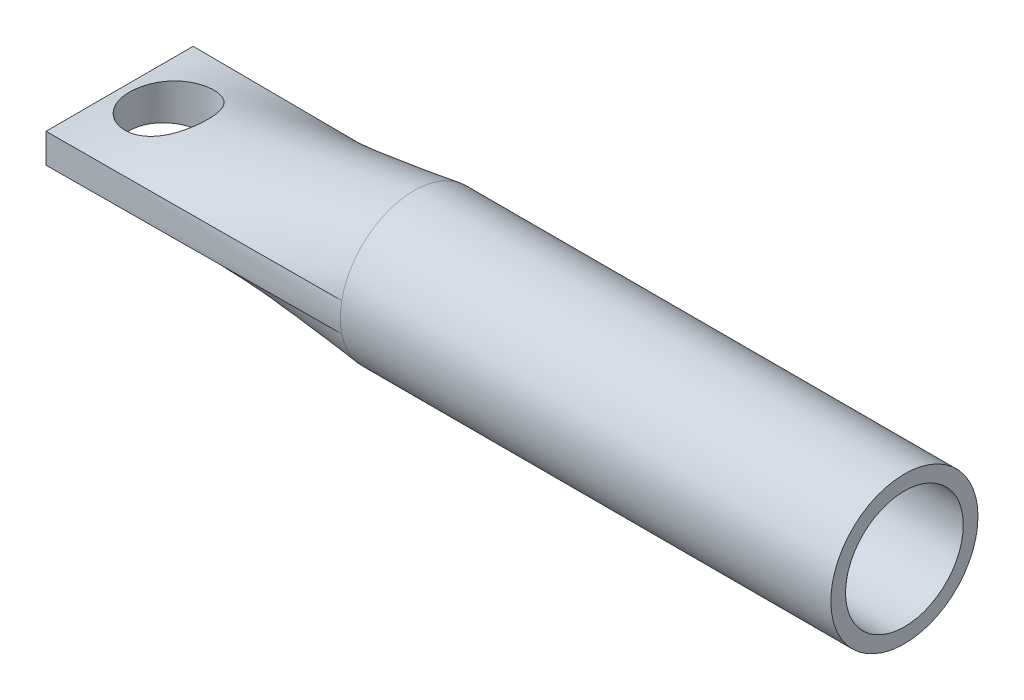
ISO-10303-21;
HEADER;
FILE_DESCRIPTION(('STEP AP214'),'2;1');
FILE_NAME('part.step','',(''),(''),'','','');
FILE_SCHEMA(('AUTOMOTIVE_DESIGN { 1 0 10303 214 1 1 1 1 }'));
ENDSEC;
DATA;
#1=APPLICATION_CONTEXT('core data for automotive mechanical design processes');
#2=APPLICATION_PROTOCOL_DEFINITION('international standard','automotive_design',2000,#1);
#3=PRODUCT_CONTEXT('',#1,'mechanical');
#4=PRODUCT('Part','Part','',(#3));
#5=PRODUCT_RELATED_PRODUCT_CATEGORY('part','',(#4));
#6=PRODUCT_DEFINITION_FORMATION('','',#4);
#7=PRODUCT_DEFINITION_CONTEXT('part definition',#1,'design');
#8=PRODUCT_DEFINITION('design','',#6,#7);
#9=PRODUCT_DEFINITION_SHAPE('','',#8);
#10=(LENGTH_UNIT() NAMED_UNIT(*) SI_UNIT(.MILLI.,.METRE.));
#11=(NAMED_UNIT(*) PLANE_ANGLE_UNIT() SI_UNIT($,.RADIAN.));
#12=(NAMED_UNIT(*) SI_UNIT($,.STERADIAN.) SOLID_ANGLE_UNIT());
#13=UNCERTAINTY_MEASURE_WITH_UNIT(LENGTH_MEASURE(1.E-05),#10,'distance_accuracy_value','');
#14=(GEOMETRIC_REPRESENTATION_CONTEXT(3) GLOBAL_UNCERTAINTY_ASSIGNED_CONTEXT((#13)) GLOBAL_UNIT_ASSIGNED_CONTEXT((#10,
#11,#12)) REPRESENTATION_CONTEXT('',''));
#15=CARTESIAN_POINT('',(0.,0.,0.));
#16=DIRECTION('',(0.,0.,1.));
#17=DIRECTION('',(1.,0.,0.));
#18=AXIS2_PLACEMENT_3D('',#15,#16,#17);
#19=CARTESIAN_POINT('',(50.,0.,0.));
#20=DIRECTION('',(-1.,0.,0.));
#21=DIRECTION('',(0.,0.,1.));
#22=AXIS2_PLACEMENT_3D('',#19,#20,#21);
#23=CYLINDRICAL_SURFACE('',#22,7.5);
#24=CARTESIAN_POINT('',(50.,0.,0.));
#25=DIRECTION('',(1.,0.,0.));
#26=DIRECTION('',(0.,0.,-1.));
#27=AXIS2_PLACEMENT_3D('',#24,#25,#26);
#28=CIRCLE('',#27,7.5);
#29=CARTESIAN_POINT('',(50.,0.,-7.5));
#30=VERTEX_POINT('',#29);
#31=EDGE_CURVE('E12',#30,#30,#28,.T.);
#32=ORIENTED_EDGE('',*,*,#31,.F.);
#33=EDGE_LOOP('',(#32));
#34=FACE_BOUND('',#33,.T.);
#35=CARTESIAN_POINT('',(0.,1.47087101353638,7.3543550676819));
#36=CARTESIAN_POINT('',(0.,2.07183255199792,7.23416275998959));
#37=CARTESIAN_POINT('',(0.,2.7214099506815,7.02829377442113));
#38=CARTESIAN_POINT('',(0.,4.04857514884579,6.35704528561685));
#39=CARTESIAN_POINT('',(0.,4.72646428939145,5.88899546935264));
#40=CARTESIAN_POINT('',(0.,5.65014306972971,4.95159735548262));
#41=CARTESIAN_POINT('',(0.,5.94177102647611,4.60048977603203));
#42=CARTESIAN_POINT('',(0.,6.46772889154709,3.82591585060274));
#43=CARTESIAN_POINT('',(0.,6.70189279433673,3.40241446086019));
#44=CARTESIAN_POINT('',(0.,7.08875869874175,2.49825765309871));
#45=CARTESIAN_POINT('',(0.,7.24127755994481,2.01767237306952));
#46=CARTESIAN_POINT('',(0.,7.44695956411141,1.02464420932239));
#47=CARTESIAN_POINT('',(0.,7.5,0.5123774391991));
#48=CARTESIAN_POINT('',(0.,7.5,-0.512377439199096));
#49=CARTESIAN_POINT('',(0.,7.44695956411141,-1.02464420932239));
#50=CARTESIAN_POINT('',(0.,7.24127755994481,-2.01767237306951));
#51=CARTESIAN_POINT('',(0.,7.08875869874176,-2.4982576530987));
#52=CARTESIAN_POINT('',(0.,6.70189279433673,-3.40241446086019));
#53=CARTESIAN_POINT('',(0.,6.46772889154709,-3.82591585060274));
#54=CARTESIAN_POINT('',(0.,5.94177102647611,-4.60048977603203));
#55=CARTESIAN_POINT('',(0.,5.65014306972971,-4.95159735548262));
#56=CARTESIAN_POINT('',(0.,4.72646428939145,-5.88899546935264));
#57=CARTESIAN_POINT('',(0.,4.04857514884579,-6.35704528561685));
#58=CARTESIAN_POINT('',(0.,2.72140995068151,-7.02829377442113));
#59=CARTESIAN_POINT('',(0.,2.07183255199792,-7.23416275998959));
#60=CARTESIAN_POINT('',(0.,1.47087101353638,-7.3543550676819));
#61=B_SPLINE_CURVE_WITH_KNOTS('',3,(#35,#36,#37,#38,#39,#40,#41,#42,#43,#44,#45,#46,#47,#48,#49,
#50,#51,#52,#53,#54,#55,#56,#57,#58,#59,#60),.UNSPECIFIED.,.F.,.F.,(4,2,2,2,2,2,2,2,2,2,2,2,4),
(0.,0.125,0.25,0.3125,0.375,0.4375,0.5,0.5625,0.625,0.6875,0.75,0.875,1.),.UNSPECIFIED.);
#62=CARTESIAN_POINT('',(0.,1.47087101353638,-7.3543550676819));
#63=VERTEX_POINT('',#62);
#64=CARTESIAN_POINT('',(0.,1.47087107283885,7.354355364444));
#65=VERTEX_POINT('',#64);
#66=EDGE_CURVE('E78',#63,#65,#61,.F.);
#67=ORIENTED_EDGE('',*,*,#66,.T.);
#68=CARTESIAN_POINT('',(0.,0.,0.));
#69=DIRECTION('',(-1.,0.,0.));
#70=DIRECTION('',(0.,0.,-1.));
#71=AXIS2_PLACEMENT_3D('',#68,#69,#70);
#72=CIRCLE('',#71,7.5);
#73=CARTESIAN_POINT('',(0.,-1.47087101353638,7.3543550676819));
#74=VERTEX_POINT('',#73);
#75=EDGE_CURVE('E124',#74,#65,#72,.T.);
#76=ORIENTED_EDGE('',*,*,#75,.F.);
#77=CARTESIAN_POINT('',(0.,0.,0.));
#78=DIRECTION('',(-1.,0.,0.));
#79=DIRECTION('',(0.,0.,-1.));
#80=AXIS2_PLACEMENT_3D('',#77,#78,#79);
#81=CIRCLE('',#80,7.5);
#82=CARTESIAN_POINT('',(0.,-1.47087101353638,-7.3543550676819));
#83=VERTEX_POINT('',#82);
#84=EDGE_CURVE('E108',#83,#74,#81,.T.);
#85=ORIENTED_EDGE('',*,*,#84,.F.);
#86=CARTESIAN_POINT('',(0.,0.,0.));
#87=DIRECTION('',(1.,0.,0.));
#88=DIRECTION('',(0.,0.,-1.));
#89=AXIS2_PLACEMENT_3D('',#86,#87,#88);
#90=CIRCLE('',#89,7.5);
#91=EDGE_CURVE('E139',#63,#83,#90,.F.);
#92=ORIENTED_EDGE('',*,*,#91,.F.);
#93=EDGE_LOOP('',(#67,#76,#85,#92));
#94=FACE_BOUND('',#93,.T.);
#95=ADVANCED_FACE('F65',(#34,#94),#23,.T.);
#96=CARTESIAN_POINT('',(50.,0.,0.));
#97=DIRECTION('',(1.,0.,0.));
#98=DIRECTION('',(0.,0.,-1.));
#99=AXIS2_PLACEMENT_3D('',#96,#97,#98);
#100=PLANE('',#99);
#101=CARTESIAN_POINT('',(50.,0.,0.));
#102=DIRECTION('',(1.,0.,0.));
#103=DIRECTION('',(0.,0.,-1.));
#104=AXIS2_PLACEMENT_3D('',#101,#102,#103);
#105=CIRCLE('',#104,6.);
#106=CARTESIAN_POINT('',(50.,0.,-6.));
#107=VERTEX_POINT('',#106);
#108=EDGE_CURVE('E357',#107,#107,#105,.T.);
#109=ORIENTED_EDGE('',*,*,#108,.F.);
#110=EDGE_LOOP('',(#109));
#111=FACE_BOUND('',#110,.T.);
#112=ORIENTED_EDGE('',*,*,#31,.T.);
#113=EDGE_LOOP('',(#112));
#114=FACE_BOUND('',#113,.T.);
#115=ADVANCED_FACE('F170',(#111,#114),#100,.T.);
#116=CARTESIAN_POINT('',(-30.,0.,0.));
#117=DIRECTION('',(-1.,0.,0.));
#118=DIRECTION('',(0.,0.,1.));
#119=AXIS2_PLACEMENT_3D('',#116,#117,#118);
#120=PLANE('',#119);
#121=DIRECTION('',(0.,-1.,0.));
#122=VECTOR('',#121,1.);
#123=CARTESIAN_POINT('',(-30.,1.5,7.5));
#124=LINE('',#123,#122);
#125=CARTESIAN_POINT('',(-30.,1.5,7.5));
#126=VERTEX_POINT('',#125);
#127=CARTESIAN_POINT('',(-30.,-1.5,7.5));
#128=VERTEX_POINT('',#127);
#129=EDGE_CURVE('E128',#126,#128,#124,.T.);
#130=ORIENTED_EDGE('',*,*,#129,.F.);
#131=DIRECTION('',(0.,0.,1.));
#132=VECTOR('',#131,1.);
#133=CARTESIAN_POINT('',(-30.,1.5,-7.5));
#134=LINE('',#133,#132);
#135=CARTESIAN_POINT('',(-30.,1.5,-7.5));
#136=VERTEX_POINT('',#135);
#137=EDGE_CURVE('E257',#136,#126,#134,.T.);
#138=ORIENTED_EDGE('',*,*,#137,.F.);
#139=DIRECTION('',(0.,1.,0.));
#140=VECTOR('',#139,1.);
#141=CARTESIAN_POINT('',(-30.,1.5,-7.5));
#142=LINE('',#141,#140);
#143=CARTESIAN_POINT('',(-30.,-1.5,-7.5));
#144=VERTEX_POINT('',#143);
#145=EDGE_CURVE('E208',#144,#136,#142,.T.);
#146=ORIENTED_EDGE('',*,*,#145,.F.);
#147=DIRECTION('',(0.,0.,-1.));
#148=VECTOR('',#147,1.);
#149=CARTESIAN_POINT('',(-30.,-1.5,-7.5));
#150=LINE('',#149,#148);
#151=EDGE_CURVE('E191',#128,#144,#150,.T.);
#152=ORIENTED_EDGE('',*,*,#151,.F.);
#153=EDGE_LOOP('',(#130,#138,#146,#152));
#154=FACE_BOUND('',#153,.T.);
#155=ADVANCED_FACE('F224',(#154),#120,.T.);
#156=CARTESIAN_POINT('',(-30.,-1.5,-7.5));
#157=CARTESIAN_POINT('',(0.,-1.47087101353638,-7.3543550676819));
#158=CARTESIAN_POINT('',(-30.,-0.999999999999998,-7.5));
#159=CARTESIAN_POINT('',(0.,-0.99010178276715,-7.45050891383575));
#160=CARTESIAN_POINT('',(-30.,-0.499999999999998,-7.5));
#161=CARTESIAN_POINT('',(0.,-0.495097567963924,-7.5));
#162=CARTESIAN_POINT('',(-30.,0.500000000000002,-7.5));
#163=CARTESIAN_POINT('',(0.,0.495097567963923,-7.5));
#164=CARTESIAN_POINT('',(-30.,1.,-7.5));
#165=CARTESIAN_POINT('',(0.,0.990101782767148,-7.45050891383575));
#166=CARTESIAN_POINT('',(-30.,1.5,-7.5));
#167=CARTESIAN_POINT('',(0.,1.47087101353638,-7.3543550676819));
#168=B_SPLINE_SURFACE_WITH_KNOTS('',3,1,((#156,#157),(#158,#159),(#160,#161),(#162,#163),(#164,
#165),(#166,#167)),.UNSPECIFIED.,.F.,.F.,.F.,(4,2,4),(2,2),(0.,0.5,1.),(0.,1.),.UNSPECIFIED.);
#169=DIRECTION('',(0.999987744145223,-0.000970954315433156,0.00485477157716525));
#170=VECTOR('',#169,1.);
#171=CARTESIAN_POINT('',(-15.,1.48543550676819,-7.42717753384095));
#172=LINE('',#171,#170);
#173=EDGE_CURVE('E141',#136,#63,#172,.T.);
#174=DIRECTION('',(-0.999987744145223,-0.000970954315433062,-0.00485477157716525));
#175=VECTOR('',#174,1.);
#176=CARTESIAN_POINT('',(-15.,-1.48543550676819,-7.42717753384095));
#177=LINE('',#176,#175);
#178=EDGE_CURVE('E115',#83,#144,#177,.T.);
#179=ORIENTED_EDGE('',*,*,#145,.T.);
#180=ORIENTED_EDGE('',*,*,#173,.T.);
#181=ORIENTED_EDGE('',*,*,#91,.T.);
#182=ORIENTED_EDGE('',*,*,#178,.T.);
#183=EDGE_LOOP('',(#179,#180,#181,#182));
#184=FACE_BOUND('',#183,.T.);
#185=ADVANCED_FACE('F212',(#184),#168,.T.);
#186=CARTESIAN_POINT('',(-30.,1.5,-7.5));
#187=CARTESIAN_POINT('',(0.,1.47087101353638,-7.3543550676819));
#188=CARTESIAN_POINT('',(-30.,1.5,-6.875));
#189=CARTESIAN_POINT('',(0.,2.07183255199792,-7.23416275998959));
#190=CARTESIAN_POINT('',(-30.,1.5,-6.25));
#191=CARTESIAN_POINT('',(0.,2.72140995068151,-7.02829377442113));
#192=CARTESIAN_POINT('',(-30.,1.5,-5.));
#193=CARTESIAN_POINT('',(0.,4.04857514884579,-6.35704528561685));
#194=CARTESIAN_POINT('',(-30.,1.5,-4.375));
#195=CARTESIAN_POINT('',(0.,4.72646428939145,-5.88899546935264));
#196=CARTESIAN_POINT('',(-30.,1.5,-3.4375));
#197=CARTESIAN_POINT('',(0.,5.65014306972971,-4.95159735548262));
#198=CARTESIAN_POINT('',(-30.,1.5,-3.125));
#199=CARTESIAN_POINT('',(0.,5.94177102647611,-4.60048977603203));
#200=CARTESIAN_POINT('',(-30.,1.5,-2.50000000000001));
#201=CARTESIAN_POINT('',(0.,6.46772889154709,-3.82591585060274));
#202=CARTESIAN_POINT('',(-30.,1.5,-2.18750000000001));
#203=CARTESIAN_POINT('',(0.,6.70189279433673,-3.40241446086019));
#204=CARTESIAN_POINT('',(-30.,1.5,-1.56250000000001));
#205=CARTESIAN_POINT('',(0.,7.08875869874176,-2.4982576530987));
#206=CARTESIAN_POINT('',(-30.,1.5,-1.25000000000001));
#207=CARTESIAN_POINT('',(0.,7.24127755994481,-2.01767237306951));
#208=CARTESIAN_POINT('',(-30.,1.5,-0.625000000000007));
#209=CARTESIAN_POINT('',(0.,7.44695956411141,-1.02464420932239));
#210=CARTESIAN_POINT('',(-30.,1.5,-0.312500000000008));
#211=CARTESIAN_POINT('',(0.,7.5,-0.512377439199096));
#212=CARTESIAN_POINT('',(-30.,1.5,0.312499999999992));
#213=CARTESIAN_POINT('',(0.,7.5,0.5123774391991));
#214=CARTESIAN_POINT('',(-30.,1.5,0.624999999999992));
#215=CARTESIAN_POINT('',(0.,7.44695956411141,1.02464420932239));
#216=CARTESIAN_POINT('',(-30.,1.5,1.24999999999999));
#217=CARTESIAN_POINT('',(0.,7.24127755994481,2.01767237306952));
#218=CARTESIAN_POINT('',(-30.,1.5,1.56249999999999));
#219=CARTESIAN_POINT('',(0.,7.08875869874175,2.49825765309871));
#220=CARTESIAN_POINT('',(-30.,1.5,2.18749999999999));
#221=CARTESIAN_POINT('',(0.,6.70189279433673,3.40241446086019));
#222=CARTESIAN_POINT('',(-30.,1.5,2.49999999999999));
#223=CARTESIAN_POINT('',(0.,6.46772889154709,3.82591585060274));
#224=CARTESIAN_POINT('',(-30.,1.5,3.125));
#225=CARTESIAN_POINT('',(0.,5.94177102647611,4.60048977603203));
#226=CARTESIAN_POINT('',(-30.,1.5,3.4375));
#227=CARTESIAN_POINT('',(0.,5.65014306972971,4.95159735548262));
#228=CARTESIAN_POINT('',(-30.,1.5,4.375));
#229=CARTESIAN_POINT('',(0.,4.72646428939145,5.88899546935264));
#230=CARTESIAN_POINT('',(-30.,1.5,5.));
#231=CARTESIAN_POINT('',(0.,4.04857514884579,6.35704528561685));
#232=CARTESIAN_POINT('',(-30.,1.5,6.25));
#233=CARTESIAN_POINT('',(0.,2.7214099506815,7.02829377442113));
#234=CARTESIAN_POINT('',(-30.,1.5,6.875));
#235=CARTESIAN_POINT('',(0.,2.07183255199792,7.23416275998959));
#236=CARTESIAN_POINT('',(-30.,1.5,7.5));
#237=CARTESIAN_POINT('',(0.,1.47087101353638,7.3543550676819));
#238=B_SPLINE_SURFACE_WITH_KNOTS('',3,1,((#186,#187),(#188,#189),(#190,#191),(#192,#193),(#194,
#195),(#196,#197),(#198,#199),(#200,#201),(#202,#203),(#204,#205),(#206,#207),(#208,#209),(#210,
#211),(#212,#213),(#214,#215),(#216,#217),(#218,#219),(#220,#221),(#222,#223),(#224,#225),(#226,
#227),(#228,#229),(#230,#231),(#232,#233),(#234,#235),(#236,#237)),.UNSPECIFIED.,.F.,.F.,.F.,(4,
2,2,2,2,2,2,2,2,2,2,2,4),(2,2),(0.,0.125,0.25,0.3125,0.375,0.4375,0.5,0.5625,0.625,0.6875,0.75,
0.875,1.),(0.,1.),.UNSPECIFIED.);
#239=CARTESIAN_POINT('',(-25.,2.14075985071414,4.));
#240=CARTESIAN_POINT('',(-24.8866527642569,2.15622376874765,4.00000354556101));
#241=CARTESIAN_POINT('',(-24.7734528742537,2.17252432952976,3.99518109820665));
#242=CARTESIAN_POINT('',(-24.5481087492595,2.20696413664853,3.97599957757425));
#243=CARTESIAN_POINT('',(-24.4359647006841,2.22510370125874,3.96163885112536));
#244=CARTESIAN_POINT('',(-24.2135646936905,2.2633145106053,3.92355164433591));
#245=CARTESIAN_POINT('',(-24.103309618093,2.28338663100424,3.89982090309167));
#246=CARTESIAN_POINT('',(-23.8854971053911,2.3254690036953,3.84324706805345));
#247=CARTESIAN_POINT('',(-23.7779406794006,2.34747996889077,3.81040061283024));
#248=CARTESIAN_POINT('',(-23.5665247377114,2.39329873047025,3.7359982716565));
#249=CARTESIAN_POINT('',(-23.462658472942,2.41710296856736,3.69445935676492));
#250=CARTESIAN_POINT('',(-23.2590507554289,2.46636311948142,3.60299291234684));
#251=CARTESIAN_POINT('',(-23.159310868916,2.49181965020263,3.55306223334653));
#252=CARTESIAN_POINT('',(-22.9646358284855,2.54408078993115,3.44523833165808));
#253=CARTESIAN_POINT('',(-22.8696993424424,2.57088502102407,3.38734733334459));
#254=CARTESIAN_POINT('',(-22.6851447579078,2.62546099497989,3.26401260558262));
#255=CARTESIAN_POINT('',(-22.5955285836478,2.65323308219937,3.19856616840696));
#256=CARTESIAN_POINT('',(-22.3311274299952,2.73870690617268,2.98808492046416));
#257=CARTESIAN_POINT('',(-22.1655632997011,2.79725840901811,2.83155072373033));
#258=CARTESIAN_POINT('',(-21.8628854248327,2.91164856672125,2.4920359775104));
#259=CARTESIAN_POINT('',(-21.7257808878962,2.96748633913473,2.30904690136244));
#260=CARTESIAN_POINT('',(-21.5434220277435,3.04528973347378,2.01633635167175));
#261=CARTESIAN_POINT('',(-21.4861346824876,3.07041921187886,1.91478584440067));
#262=CARTESIAN_POINT('',(-21.3804230748795,3.11775731234944,1.70654012617705));
#263=CARTESIAN_POINT('',(-21.3319949012636,3.13996722215976,1.59984721197674));
#264=CARTESIAN_POINT('',(-21.2445190624247,3.1807477803646,1.38207415997178));
#265=CARTESIAN_POINT('',(-21.20546674029,3.19932023460656,1.2709962322267));
#266=CARTESIAN_POINT('',(-21.1371808917208,3.23215912590566,1.04524095639025));
#267=CARTESIAN_POINT('',(-21.1079463068255,3.24642602713224,0.930563997772815));
#268=CARTESIAN_POINT('',(-21.0616147614496,3.26920716677001,0.707823774313331));
#269=CARTESIAN_POINT('',(-21.0437373484616,3.27808870233707,0.599959944461138));
#270=CARTESIAN_POINT('',(-21.0168639218247,3.29150169849631,0.382866495502732));
#271=CARTESIAN_POINT('',(-21.007867135412,3.29603353758431,0.273636996070518));
#272=CARTESIAN_POINT('',(-20.9988757161691,3.30056262207617,0.054753260754095));
#273=CARTESIAN_POINT('',(-20.9988778309598,3.30056150577887,-0.0549008073540542));
#274=CARTESIAN_POINT('',(-21.0078753520326,3.2960294438788,-0.273740824772415));
#275=CARTESIAN_POINT('',(-21.0168704367771,3.29149866023121,-0.38292679067913));
#276=CARTESIAN_POINT('',(-21.0426960591071,3.2786082311414,-0.591540951133993));
#277=CARTESIAN_POINT('',(-21.0588675199979,3.27057145663217,-0.691071275225243));
#278=CARTESIAN_POINT('',(-21.0985849409597,3.25101851286886,-0.888310916196252));
#279=CARTESIAN_POINT('',(-21.1221332059284,3.23950125617066,-0.986019653793854));
#280=CARTESIAN_POINT('',(-21.2035054987596,3.20014481639297,-1.27542529656295));
#281=CARTESIAN_POINT('',(-21.2720774979347,3.16749024226736,-1.46356383066151));
#282=CARTESIAN_POINT('',(-21.4387558186547,3.09118265538828,-1.83311899410855));
#283=CARTESIAN_POINT('',(-21.5379347920621,3.0471416057434,-2.01396482509046));
#284=CARTESIAN_POINT('',(-21.7618839498163,2.95281558138707,-2.35725595937188));
#285=CARTESIAN_POINT('',(-21.8866660703632,2.90252769872925,-2.51969262528003));
#286=CARTESIAN_POINT('',(-22.1726475338731,2.7947360971238,-2.83835138079659));
#287=CARTESIAN_POINT('',(-22.3362230416076,2.73700946385656,-2.99238618664038));
#288=CARTESIAN_POINT('',(-22.5993074072973,2.65203738151789,-3.2014487210305));
#289=CARTESIAN_POINT('',(-22.6900139020153,2.62396707104787,-3.26750344300075));
#290=CARTESIAN_POINT('',(-22.8768566296938,2.56882593706448,-3.39187814469532));
#291=CARTESIAN_POINT('',(-22.9729908000027,2.54175474024511,-3.4502010348705));
#292=CARTESIAN_POINT('',(-23.1733440297502,2.48814694837984,-3.56045360783826));
#293=CARTESIAN_POINT('',(-23.2777246050979,2.46165669905951,-3.61211223502244));
#294=CARTESIAN_POINT('',(-23.4909321666992,2.41049763374819,-3.70624966811767));
#295=CARTESIAN_POINT('',(-23.5997575088573,2.3858281535747,-3.74873183243497));
#296=CARTESIAN_POINT('',(-23.8211069415025,2.33850569385934,-3.82411834544313));
#297=CARTESIAN_POINT('',(-23.9336311245869,2.31585276485283,-3.8570224541521));
#298=CARTESIAN_POINT('',(-24.161514519515,2.27265116575706,-3.91288937822839));
#299=CARTESIAN_POINT('',(-24.2768736246901,2.25210241664454,-3.93585256703539));
#300=CARTESIAN_POINT('',(-24.5053713789459,2.21377788080357,-3.97092238849998));
#301=CARTESIAN_POINT('',(-24.6184432071757,2.19592949207546,-3.98338589980636));
#302=CARTESIAN_POINT('',(-24.8455506478777,2.16205407620639,-3.99863749114317));
#303=CARTESIAN_POINT('',(-24.9595865817393,2.14602768441014,-4.00142220605007));
#304=CARTESIAN_POINT('',(-25.1876535088621,2.11563998299501,-3.99722270152886));
#305=CARTESIAN_POINT('',(-25.3016844858427,2.10127800969483,-3.99024239048591));
#306=CARTESIAN_POINT('',(-25.5289437898915,2.07399334298698,-3.96651930439475));
#307=CARTESIAN_POINT('',(-25.6421718050158,2.06107118302085,-3.94977292531161));
#308=CARTESIAN_POINT('',(-25.8647987299646,2.03666700592543,-3.90701040870143));
#309=CARTESIAN_POINT('',(-25.974229650009,2.02516257842178,-3.88117345570366));
#310=CARTESIAN_POINT('',(-26.190654835117,2.0030888139908,-3.82033777051647));
#311=CARTESIAN_POINT('',(-26.2976482008549,1.99251981816738,-3.78533571455088));
#312=CARTESIAN_POINT('',(-26.5083230115933,1.97211333220395,-3.70642813361561));
#313=CARTESIAN_POINT('',(-26.6120057426315,1.9622755559955,-3.66252611582069));
#314=CARTESIAN_POINT('',(-26.8153799160555,1.94313817031308,-3.56609944844742));
#315=CARTESIAN_POINT('',(-26.9150698701287,1.93383876095115,-3.51357162011912));
#316=CARTESIAN_POINT('',(-27.109759141473,1.91562829670375,-3.40023713004023));
#317=CARTESIAN_POINT('',(-27.2047551063458,1.90671751989376,-3.33942466469616));
#318=CARTESIAN_POINT('',(-27.3893257942583,1.88918691160066,-3.20995856431909));
#319=CARTESIAN_POINT('',(-27.4788985011772,1.88056718883856,-3.14130204027358));
#320=CARTESIAN_POINT('',(-27.6519079156729,1.86357638245866,-2.99668016190806));
#321=CARTESIAN_POINT('',(-27.7353467248949,1.85520521427064,-2.92071733171951));
#322=CARTESIAN_POINT('',(-27.8955526377089,1.83871043464577,-2.76197326078713));
#323=CARTESIAN_POINT('',(-27.9723172657904,1.83058691578349,-2.67918951209305));
#324=CARTESIAN_POINT('',(-28.1185591494761,1.81465571301258,-2.50744952458443));
#325=CARTESIAN_POINT('',(-28.1880394787003,1.80684789675412,-2.41849591569171));
#326=CARTESIAN_POINT('',(-28.3192760618802,1.79165281931775,-2.23498068345108));
#327=CARTESIAN_POINT('',(-28.381029442203,1.78426571515479,-2.14041699288702));
#328=CARTESIAN_POINT('',(-28.4963179882352,1.77006822359266,-1.94640234835231));
#329=CARTESIAN_POINT('',(-28.5498561630694,1.76325762543851,-1.84695320156733));
#330=CARTESIAN_POINT('',(-28.648363698001,1.75039170905083,-1.64383909363546));
#331=CARTESIAN_POINT('',(-28.6933299012216,1.74433666935607,-1.54017259631605));
#332=CARTESIAN_POINT('',(-28.8145365829959,1.72764951668395,-1.22467534280069));
#333=CARTESIAN_POINT('',(-28.8775813606318,1.71843166389097,-1.0075098973022));
#334=CARTESIAN_POINT('',(-28.9662179070573,1.70523784721799,-0.565643952078955));
#335=CARTESIAN_POINT('',(-28.9918138236567,1.70126130281915,-0.340944289659281));
#336=CARTESIAN_POINT('',(-29.0047772864075,1.69926288893767,0.107414860714038));
#337=CARTESIAN_POINT('',(-28.9925147218498,1.70118340234346,0.331063165620732));
#338=CARTESIAN_POINT('',(-28.9309243230102,1.71051453079829,0.773071655501811));
#339=CARTESIAN_POINT('',(-28.881595381947,1.7179253097835,0.991431682370197));
#340=CARTESIAN_POINT('',(-28.7474853439854,1.7370048885465,1.41629078207317));
#341=CARTESIAN_POINT('',(-28.6627748293943,1.74866520509938,1.62281254326666));
#342=CARTESIAN_POINT('',(-28.460337910183,1.77472490621427,2.01878942556967));
#343=CARTESIAN_POINT('',(-28.3426108604068,1.78912434429801,2.2082442130883));
#344=CARTESIAN_POINT('',(-28.0761286364995,1.81956185034003,2.56666813353009));
#345=CARTESIAN_POINT('',(-27.9270816358868,1.83561454942156,2.73541910571549));
#346=CARTESIAN_POINT('',(-27.6028600900118,1.86863947029825,3.04556216977752));
#347=CARTESIAN_POINT('',(-27.4276811963922,1.8856118448279,3.18694969935406));
#348=CARTESIAN_POINT('',(-27.0552760008885,1.92082207682881,3.43899145579186));
#349=CARTESIAN_POINT('',(-26.8579425786636,1.93906590555325,3.54948647966519));
#350=CARTESIAN_POINT('',(-26.4477782778554,1.97781785688442,3.73558110566056));
#351=CARTESIAN_POINT('',(-26.2349591210385,1.99832427279709,3.81120679009071));
#352=CARTESIAN_POINT('',(-25.8514294396767,2.03794955138888,3.9121176227466));
#353=CARTESIAN_POINT('',(-25.682600972964,2.05625851273732,3.94506264227509));
#354=CARTESIAN_POINT('',(-25.3424031564266,2.09599663996187,3.98900104134323));
#355=CARTESIAN_POINT('',(-25.1710338331375,2.11742577327276,3.99999464997195));
#356=CARTESIAN_POINT('',(-25.,2.14075985071414,4.));
#357=B_SPLINE_CURVE_WITH_KNOTS('',3,(#239,#240,#241,#242,#243,#244,#245,#246,#247,#248,#249,
#250,#251,#252,#253,#254,#255,#256,#257,#258,#259,#260,#261,#262,#263,#264,#265,#266,#267,#268,
#269,#270,#271,#272,#273,#274,#275,#276,#277,#278,#279,#280,#281,#282,#283,#284,#285,#286,#287,
#288,#289,#290,#291,#292,#293,#294,#295,#296,#297,#298,#299,#300,#301,#302,#303,#304,#305,#306,
#307,#308,#309,#310,#311,#312,#313,#314,#315,#316,#317,#318,#319,#320,#321,#322,#323,#324,#325,
#326,#327,#328,#329,#330,#331,#332,#333,#334,#335,#336,#337,#338,#339,#340,#341,#342,#343,#344,
#345,#346,#347,#348,#349,#350,#351,#352,#353,#354,#355,#356),.UNSPECIFIED.,.T.,.F.,(4,2,2,2,2,2,
2,2,2,2,2,2,2,2,2,2,2,2,2,2,2,2,2,2,2,2,2,2,2,2,2,2,2,2,2,2,2,2,2,2,2,2,2,2,2,2,2,2,2,2,2,2,2,2,
2,2,2,2,4),(0.,0.343030567368772,0.686120604183193,1.02936683715778,1.37273981110959,
1.71544853998136,2.05828617766304,2.40102820919691,2.74389345659056,3.446254912773,
4.14884325359307,4.50626164915889,4.86352186409969,5.22060426188732,5.57764814987228,
5.90629363848662,6.23491052689374,6.56340864673378,6.89189502176619,7.19500193487883,
7.49820364899763,8.10412146815075,8.73430105163702,9.36477509542709,10.0573367558323,
10.4040229584775,10.7505782871323,11.1084535343335,11.4661975834332,11.8239505951774,
12.1816901664386,12.5267140733946,12.8718579262549,13.2168636771536,13.5619968283853,
13.9006765475259,14.2394792612952,14.5781487229665,14.9169432710198,15.2559763852861,
15.5951347724209,15.9341764074948,16.2733432642426,16.6123664281486,16.9515153015285,
17.2905396509383,17.6296886156901,18.3050986140318,18.9804337987666,19.6491916987564,
20.317969568277,20.985419624608,21.6528827240815,22.3268650583025,23.0009596688071,
23.678466716355,24.3554661623759,24.8730830652924,25.3906945662326),.UNSPECIFIED.);
#358=CARTESIAN_POINT('',(-25.,2.14075985071414,4.));
#359=VERTEX_POINT('',#358);
#360=EDGE_CURVE('E133',#359,#359,#357,.T.);
#361=DIRECTION('',(0.999987744145223,-0.000970954315433077,-0.00485477157716531));
#362=VECTOR('',#361,1.);
#363=CARTESIAN_POINT('',(-15.,1.48543550676819,7.42717753384095));
#364=LINE('',#363,#362);
#365=EDGE_CURVE('E86',#126,#65,#364,.T.);
#366=ORIENTED_EDGE('',*,*,#360,.F.);
#367=EDGE_LOOP('',(#366));
#368=FACE_BOUND('',#367,.T.);
#369=ORIENTED_EDGE('',*,*,#137,.T.);
#370=ORIENTED_EDGE('',*,*,#365,.T.);
#371=ORIENTED_EDGE('',*,*,#66,.F.);
#372=ORIENTED_EDGE('',*,*,#173,.F.);
#373=EDGE_LOOP('',(#369,#370,#371,#372));
#374=FACE_BOUND('',#373,.T.);
#375=ADVANCED_FACE('F223',(#368,#374),#238,.T.);
#376=CARTESIAN_POINT('',(-30.,-1.5,7.5));
#377=CARTESIAN_POINT('',(0.,-1.47087101353638,7.3543550676819));
#378=CARTESIAN_POINT('',(-30.,-1.5,6.875));
#379=CARTESIAN_POINT('',(0.,-2.07183255199792,7.23416275998959));
#380=CARTESIAN_POINT('',(-30.,-1.5,6.25));
#381=CARTESIAN_POINT('',(0.,-2.7214099506815,7.02829377442113));
#382=CARTESIAN_POINT('',(-30.,-1.5,5.));
#383=CARTESIAN_POINT('',(0.,-4.04857514884579,6.35704528561685));
#384=CARTESIAN_POINT('',(-30.,-1.5,4.375));
#385=CARTESIAN_POINT('',(0.,-4.72646428939145,5.88899546935264));
#386=CARTESIAN_POINT('',(-30.,-1.5,3.4375));
#387=CARTESIAN_POINT('',(0.,-5.65014306972971,4.95159735548262));
#388=CARTESIAN_POINT('',(-30.,-1.5,3.125));
#389=CARTESIAN_POINT('',(0.,-5.94177102647611,4.60048977603203));
#390=CARTESIAN_POINT('',(-30.,-1.5,2.50000000000001));
#391=CARTESIAN_POINT('',(0.,-6.46772889154709,3.82591585060274));
#392=CARTESIAN_POINT('',(-30.,-1.5,2.18750000000001));
#393=CARTESIAN_POINT('',(0.,-6.70189279433673,3.40241446086019));
#394=CARTESIAN_POINT('',(-30.,-1.5,1.56250000000001));
#395=CARTESIAN_POINT('',(0.,-7.08875869874176,2.4982576530987));
#396=CARTESIAN_POINT('',(-30.,-1.5,1.25000000000001));
#397=CARTESIAN_POINT('',(0.,-7.24127755994481,2.01767237306951));
#398=CARTESIAN_POINT('',(-30.,-1.5,0.625000000000008));
#399=CARTESIAN_POINT('',(0.,-7.44695956411141,1.02464420932239));
#400=CARTESIAN_POINT('',(-30.,-1.5,0.312500000000009));
#401=CARTESIAN_POINT('',(0.,-7.5,0.512377439199097));
#402=CARTESIAN_POINT('',(-30.,-1.5,-0.312499999999991));
#403=CARTESIAN_POINT('',(0.,-7.5,-0.512377439199099));
#404=CARTESIAN_POINT('',(-30.,-1.5,-0.624999999999991));
#405=CARTESIAN_POINT('',(0.,-7.44695956411141,-1.02464420932239));
#406=CARTESIAN_POINT('',(-30.,-1.5,-1.24999999999999));
#407=CARTESIAN_POINT('',(0.,-7.24127755994481,-2.01767237306951));
#408=CARTESIAN_POINT('',(-30.,-1.5,-1.56249999999999));
#409=CARTESIAN_POINT('',(0.,-7.08875869874175,-2.49825765309871));
#410=CARTESIAN_POINT('',(-30.,-1.5,-2.18749999999999));
#411=CARTESIAN_POINT('',(0.,-6.70189279433673,-3.40241446086019));
#412=CARTESIAN_POINT('',(-30.,-1.5,-2.49999999999999));
#413=CARTESIAN_POINT('',(0.,-6.46772889154709,-3.82591585060274));
#414=CARTESIAN_POINT('',(-30.,-1.5,-3.12499999999999));
#415=CARTESIAN_POINT('',(0.,-5.94177102647611,-4.60048977603203));
#416=CARTESIAN_POINT('',(-30.,-1.5,-3.43749999999999));
#417=CARTESIAN_POINT('',(0.,-5.6501430697297,-4.95159735548262));
#418=CARTESIAN_POINT('',(-30.,-1.5,-4.37499999999999));
#419=CARTESIAN_POINT('',(0.,-4.72646428939145,-5.88899546935264));
#420=CARTESIAN_POINT('',(-30.,-1.5,-4.99999999999999));
#421=CARTESIAN_POINT('',(0.,-4.04857514884579,-6.35704528561685));
#422=CARTESIAN_POINT('',(-30.,-1.5,-6.25));
#423=CARTESIAN_POINT('',(0.,-2.72140995068151,-7.02829377442113));
#424=CARTESIAN_POINT('',(-30.,-1.5,-6.875));
#425=CARTESIAN_POINT('',(0.,-2.07183255199792,-7.23416275998959));
#426=CARTESIAN_POINT('',(-30.,-1.5,-7.5));
#427=CARTESIAN_POINT('',(0.,-1.47087101353638,-7.3543550676819));
#428=B_SPLINE_SURFACE_WITH_KNOTS('',3,1,((#376,#377),(#378,#379),(#380,#381),(#382,#383),(#384,
#385),(#386,#387),(#388,#389),(#390,#391),(#392,#393),(#394,#395),(#396,#397),(#398,#399),(#400,
#401),(#402,#403),(#404,#405),(#406,#407),(#408,#409),(#410,#411),(#412,#413),(#414,#415),(#416,
#417),(#418,#419),(#420,#421),(#422,#423),(#424,#425),(#426,#427)),.UNSPECIFIED.,.F.,.F.,.F.,(4,
2,2,2,2,2,2,2,2,2,2,2,4),(2,2),(0.,0.125,0.25,0.3125,0.375,0.4375,0.5,0.5625,0.625,0.6875,0.75,
0.875,1.),(0.,1.),.UNSPECIFIED.);
#429=CARTESIAN_POINT('',(-25.,-2.14075985071414,4.));
#430=CARTESIAN_POINT('',(-25.2239415892124,-2.11020741987932,3.9999896597488));
#431=CARTESIAN_POINT('',(-25.4484245711549,-2.08293554415575,3.98112668474896));
#432=CARTESIAN_POINT('',(-25.8916522725416,-2.03329408296013,3.90583687090115));
#433=CARTESIAN_POINT('',(-26.1103932873936,-2.01092759707451,3.84938637187703));
#434=CARTESIAN_POINT('',(-26.5354679444065,-1.96929750366306,3.70040954290369));
#435=CARTESIAN_POINT('',(-26.7418055467637,-1.95003290242576,3.60789479902144));
#436=CARTESIAN_POINT('',(-27.1360587677352,-1.91317495718977,3.38940241898819));
#437=CARTESIAN_POINT('',(-27.3239764972783,-1.89558142169309,3.26342862341798));
#438=CARTESIAN_POINT('',(-27.6760521270027,-1.86134153790895,2.98154645777073));
#439=CARTESIAN_POINT('',(-27.8402008253017,-1.84469555796118,2.82562654848592));
#440=CARTESIAN_POINT('',(-28.1399512869824,-1.81252041013516,2.48829673984102));
#441=CARTESIAN_POINT('',(-28.2755518066725,-1.79699129093195,2.30688573054382));
#442=CARTESIAN_POINT('',(-28.514176739619,-1.76805046323501,1.92390454222144));
#443=CARTESIAN_POINT('',(-28.6172381044013,-1.754636361656,1.72235757466758));
#444=CARTESIAN_POINT('',(-28.7879953399207,-1.73142652764472,1.30460751202221));
#445=CARTESIAN_POINT('',(-28.8556935460221,-1.72163055628555,1.08840538581526));
#446=CARTESIAN_POINT('',(-28.9533973751065,-1.70719159176951,0.648862847200754));
#447=CARTESIAN_POINT('',(-28.9836309650187,-1.70251745332917,0.425574172094062));
#448=CARTESIAN_POINT('',(-29.0062308890657,-1.69904095441604,-0.0229483488360887));
#449=CARTESIAN_POINT('',(-28.9985998773849,-1.70023818237966,-0.248182057214281));
#450=CARTESIAN_POINT('',(-28.9459576925335,-1.70825076819782,-0.692035509179826));
#451=CARTESIAN_POINT('',(-28.9012880006163,-1.71501479822715,-0.910696834404854));
#452=CARTESIAN_POINT('',(-28.7763429476344,-1.73297231908117,-1.33740970736637));
#453=CARTESIAN_POINT('',(-28.6960653159818,-1.74416609236945,-1.54546057756957));
#454=CARTESIAN_POINT('',(-28.5017061791778,-1.76954177801765,-1.94625631067352));
#455=CARTESIAN_POINT('',(-28.3874519049998,-1.78373885281563,-2.1389164017969));
#456=CARTESIAN_POINT('',(-28.1285220317785,-1.81375865775242,-2.50242862473429));
#457=CARTESIAN_POINT('',(-27.9838458876361,-1.82958141701764,-2.67328036569814));
#458=CARTESIAN_POINT('',(-27.6667384484008,-1.86230526213451,-2.98983717777313));
#459=CARTESIAN_POINT('',(-27.4940768511519,-1.87921452489369,-3.13531078297496));
#460=CARTESIAN_POINT('',(-27.1268500573402,-1.91413850041609,-3.39515891731434));
#461=CARTESIAN_POINT('',(-26.9322842883979,-1.93215324206105,-3.50953263351172));
#462=CARTESIAN_POINT('',(-26.5263822988875,-1.97031827315369,-3.7041783197528));
#463=CARTESIAN_POINT('',(-26.3150062292148,-1.99047367741936,-3.78436620874072));
#464=CARTESIAN_POINT('',(-25.8821404247851,-2.03449231586832,-3.90800316493015));
#465=CARTESIAN_POINT('',(-25.6606509281356,-2.05835546278935,-3.9514530966098));
#466=CARTESIAN_POINT('',(-25.2142733641949,-2.1116147099816,-4.00055969859225));
#467=CARTESIAN_POINT('',(-24.9893868467004,-2.14100835329267,-4.00623311079532));
#468=CARTESIAN_POINT('',(-24.5428759646969,-2.20685104355406,-3.98008155383268));
#469=CARTESIAN_POINT('',(-24.3212513299167,-2.24329950237855,-3.94825970934075));
#470=CARTESIAN_POINT('',(-23.8877707132443,-2.32383351671041,-3.84868828032483));
#471=CARTESIAN_POINT('',(-23.6759118773597,-2.36791682283541,-3.78094926565086));
#472=CARTESIAN_POINT('',(-23.2675710219283,-2.46292655175086,-3.61213555866479));
#473=CARTESIAN_POINT('',(-23.0710915889421,-2.51385412173665,-3.51105527374489));
#474=CARTESIAN_POINT('',(-22.6940378838749,-2.62139184231493,-3.27613106228778));
#475=CARTESIAN_POINT('',(-22.513923665239,-2.678104440596,-3.14159802885846));
#476=CARTESIAN_POINT('',(-22.1786662063241,-2.79230061231049,-2.84433528992238));
#477=CARTESIAN_POINT('',(-22.0235344520327,-2.84978452728315,-2.68159268571844));
#478=CARTESIAN_POINT('',(-21.8101375555467,-2.9337143867945,-2.41625598179113));
#479=CARTESIAN_POINT('',(-21.7412451540831,-2.96175573920322,-2.32251899177044));
#480=CARTESIAN_POINT('',(-21.6116705042953,-3.01592039541067,-2.12902790457301));
#481=CARTESIAN_POINT('',(-21.5509847900152,-3.04204450677862,-2.02927637343439));
#482=CARTESIAN_POINT('',(-21.4383274106004,-3.0916323588146,-1.82432669128991));
#483=CARTESIAN_POINT('',(-21.3863565417431,-3.1150958563184,-1.71912804372788));
#484=CARTESIAN_POINT('',(-21.2916700677854,-3.15862461033203,-1.50402346953154));
#485=CARTESIAN_POINT('',(-21.2489495868895,-3.17869165585697,-1.39412005950384));
#486=CARTESIAN_POINT('',(-21.1749963553022,-3.21389064163381,-1.17559498024476));
#487=CARTESIAN_POINT('',(-21.1433197965061,-3.22920949129947,-1.06715374048244));
#488=CARTESIAN_POINT('',(-21.0891738822723,-3.25561501984704,-0.847486055918761));
#489=CARTESIAN_POINT('',(-21.0667042959801,-3.26670180484278,-0.736259681025766));
#490=CARTESIAN_POINT('',(-21.0312833186752,-3.28428169051777,-0.512019241281513));
#491=CARTESIAN_POINT('',(-21.0183253463186,-3.29077796737783,-0.399006467902275));
#492=CARTESIAN_POINT('',(-21.0020871019131,-3.29893759724008,-0.172117427775249));
#493=CARTESIAN_POINT('',(-20.9988059630787,-3.30060138310397,-0.0582412392825154));
#494=CARTESIAN_POINT('',(-21.0018115381277,-3.29908622537414,0.158249624316572));
#495=CARTESIAN_POINT('',(-21.0071978742115,-3.29636297539911,0.260881348295189));
#496=CARTESIAN_POINT('',(-21.0258244638214,-3.28702275941046,0.465250136853041));
#497=CARTESIAN_POINT('',(-21.039064739148,-3.28040578258889,0.566987198948139));
#498=CARTESIAN_POINT('',(-21.0732524746258,-3.2634726230813,0.768849716133216));
#499=CARTESIAN_POINT('',(-21.0942001346014,-3.25315634448603,0.868975129368754));
#500=CARTESIAN_POINT('',(-21.143564097947,-3.22909910902605,1.06692153401235));
#501=CARTESIAN_POINT('',(-21.1719805991044,-3.2153580614683,1.16474246431912));
#502=CARTESIAN_POINT('',(-21.2678743504293,-3.16963083501357,1.45333301959082));
#503=CARTESIAN_POINT('',(-21.3461161595533,-3.13307799358844,1.63992871051434));
#504=CARTESIAN_POINT('',(-21.5287316218738,-3.05138839287897,1.99768120950164));
#505=CARTESIAN_POINT('',(-21.6331148066898,-3.00624850404781,2.16883235517232));
#506=CARTESIAN_POINT('',(-21.8762635079964,-2.90675655213391,2.50793717277356));
#507=CARTESIAN_POINT('',(-22.0173257222063,-2.85193806602549,2.67410861975326));
#508=CARTESIAN_POINT('',(-22.3244497759713,-2.74135650045864,2.98137504288537));
#509=CARTESIAN_POINT('',(-22.4905236342623,-2.68559297838129,3.12245789185912));
#510=CARTESIAN_POINT('',(-22.7612569997151,-2.60251488760513,3.31684888675552));
#511=CARTESIAN_POINT('',(-22.8583875120964,-2.57407370136785,3.38038360765911));
#512=CARTESIAN_POINT('',(-23.0580751268322,-2.51852942771669,3.49891305919106));
#513=CARTESIAN_POINT('',(-23.1606303381601,-2.49142588029391,3.55391073983103));
#514=CARTESIAN_POINT('',(-23.3704422832878,-2.43894178271706,3.65487160172536));
#515=CARTESIAN_POINT('',(-23.4776962557889,-2.41356024237165,3.70084000433192));
#516=CARTESIAN_POINT('',(-23.6961637347432,-2.36475720662953,3.78333881791238));
#517=CARTESIAN_POINT('',(-23.8073764739422,-2.34133533434332,3.81987104651468));
#518=CARTESIAN_POINT('',(-24.0948092750516,-2.28432022355136,3.90044326445372));
#519=CARTESIAN_POINT('',(-24.2732925877876,-2.25217670959162,3.93764782928468));
#520=CARTESIAN_POINT('',(-24.6343968872894,-2.19287878918368,3.98742994406473));
#521=CARTESIAN_POINT('',(-24.8170177133264,-2.16572418930464,4.00000844900144));
#522=CARTESIAN_POINT('',(-25.,-2.14075985071414,4.));
#523=B_SPLINE_CURVE_WITH_KNOTS('',3,(#429,#430,#431,#432,#433,#434,#435,#436,#437,#438,#439,
#440,#441,#442,#443,#444,#445,#446,#447,#448,#449,#450,#451,#452,#453,#454,#455,#456,#457,#458,
#459,#460,#461,#462,#463,#464,#465,#466,#467,#468,#469,#470,#471,#472,#473,#474,#475,#476,#477,
#478,#479,#480,#481,#482,#483,#484,#485,#486,#487,#488,#489,#490,#491,#492,#493,#494,#495,#496,
#497,#498,#499,#500,#501,#502,#503,#504,#505,#506,#507,#508,#509,#510,#511,#512,#513,#514,#515,
#516,#517,#518,#519,#520,#521,#522),.UNSPECIFIED.,.T.,.F.,(4,2,2,2,2,2,2,2,2,2,2,2,2,2,2,2,2,2,
2,2,2,2,2,2,2,2,2,2,2,2,2,2,2,2,2,2,2,2,2,2,2,2,2,2,2,2,4),(0.,0.677406703943969,
1.35524021793604,2.03285614908734,2.71039433401609,3.38819412206668,4.06602343212304,
4.74308020601602,5.4200922617814,6.0929642375405,6.76578904784861,7.43247878125494,
8.09921103313525,8.76939329818854,9.43958757259023,10.1156067717995,10.791643640215,
11.469333780723,12.1470079741111,12.8243818140126,13.5016992088384,14.1788173905005,
14.8560492086184,15.548593104101,16.241454501477,16.6000727235107,16.9585390130041,
17.3170380378179,17.6753476385766,18.016900287884,18.3584443726156,18.6997519103793,
19.0410288751898,19.3490808929793,19.6571337658428,19.9651946259585,20.2732636448581,
20.8872931016204,21.5015467714512,22.1730061768718,22.8447892713319,23.2029169589108,
23.5609206170795,23.9187166393607,24.2764436902541,24.8299730068579,25.3834808574166),.UNSPECIFIED.);
#524=CARTESIAN_POINT('',(-25.,-2.14075985071414,4.));
#525=VERTEX_POINT('',#524);
#526=EDGE_CURVE('E69',#525,#525,#523,.T.);
#527=DIRECTION('',(0.999987744145223,0.000970954315433091,-0.00485477157716534));
#528=VECTOR('',#527,1.);
#529=CARTESIAN_POINT('',(-15.,-1.48543550676819,7.42717753384095));
#530=LINE('',#529,#528);
#531=EDGE_CURVE('E113',#128,#74,#530,.T.);
#532=ORIENTED_EDGE('',*,*,#526,.F.);
#533=EDGE_LOOP('',(#532));
#534=FACE_BOUND('',#533,.T.);
#535=ORIENTED_EDGE('',*,*,#151,.T.);
#536=ORIENTED_EDGE('',*,*,#178,.F.);
#537=ORIENTED_EDGE('',*,*,#84,.T.);
#538=ORIENTED_EDGE('',*,*,#531,.F.);
#539=EDGE_LOOP('',(#535,#536,#537,#538));
#540=FACE_BOUND('',#539,.T.);
#541=ADVANCED_FACE('F112',(#534,#540),#428,.T.);
#542=CARTESIAN_POINT('',(-30.,1.5,7.5));
#543=CARTESIAN_POINT('',(0.,1.47087101353638,7.3543550676819));
#544=CARTESIAN_POINT('',(-30.,0.999999999999999,7.5));
#545=CARTESIAN_POINT('',(0.,0.990101782767148,7.45050891383575));
#546=CARTESIAN_POINT('',(-30.,0.499999999999999,7.5));
#547=CARTESIAN_POINT('',(0.,0.495097567963923,7.5));
#548=CARTESIAN_POINT('',(-30.,-0.500000000000001,7.5));
#549=CARTESIAN_POINT('',(0.,-0.495097567963925,7.5));
#550=CARTESIAN_POINT('',(-30.,-1.,7.5));
#551=CARTESIAN_POINT('',(0.,-0.99010178276715,7.45050891383575));
#552=CARTESIAN_POINT('',(-30.,-1.5,7.5));
#553=CARTESIAN_POINT('',(0.,-1.47087101353638,7.3543550676819));
#554=B_SPLINE_SURFACE_WITH_KNOTS('',3,1,((#542,#543),(#544,#545),(#546,#547),(#548,#549),(#550,
#551),(#552,#553)),.UNSPECIFIED.,.F.,.F.,.F.,(4,2,4),(2,2),(0.,0.5,1.),(0.,1.),.UNSPECIFIED.);
#555=ORIENTED_EDGE('',*,*,#129,.T.);
#556=ORIENTED_EDGE('',*,*,#531,.T.);
#557=ORIENTED_EDGE('',*,*,#75,.T.);
#558=ORIENTED_EDGE('',*,*,#365,.F.);
#559=EDGE_LOOP('',(#555,#556,#557,#558));
#560=FACE_BOUND('',#559,.T.);
#561=ADVANCED_FACE('F123',(#560),#554,.T.);
#562=CARTESIAN_POINT('',(-25.,-10.,0.));
#563=DIRECTION('',(0.,1.,0.));
#564=DIRECTION('',(0.,0.,1.));
#565=AXIS2_PLACEMENT_3D('',#562,#563,#564);
#566=CYLINDRICAL_SURFACE('',#565,4.);
#567=ORIENTED_EDGE('',*,*,#360,.T.);
#568=EDGE_LOOP('',(#567));
#569=FACE_BOUND('',#568,.T.);
#570=ORIENTED_EDGE('',*,*,#526,.T.);
#571=EDGE_LOOP('',(#570));
#572=FACE_BOUND('',#571,.T.);
#573=ADVANCED_FACE('F165',(#569,#572),#566,.F.);
#574=CARTESIAN_POINT('',(35.,0.,0.));
#575=DIRECTION('',(1.,0.,0.));
#576=DIRECTION('',(0.,0.,-1.));
#577=AXIS2_PLACEMENT_3D('',#574,#575,#576);
#578=CYLINDRICAL_SURFACE('',#577,6.);
#579=CARTESIAN_POINT('',(35.,0.,0.));
#580=DIRECTION('',(1.,0.,0.));
#581=DIRECTION('',(0.,0.,-1.));
#582=AXIS2_PLACEMENT_3D('',#579,#580,#581);
#583=CIRCLE('',#582,6.);
#584=CARTESIAN_POINT('',(35.,0.,-6.));
#585=VERTEX_POINT('',#584);
#586=EDGE_CURVE('E360',#585,#585,#583,.T.);
#587=ORIENTED_EDGE('',*,*,#586,.F.);
#588=EDGE_LOOP('',(#587));
#589=FACE_BOUND('',#588,.T.);
#590=ORIENTED_EDGE('',*,*,#108,.T.);
#591=EDGE_LOOP('',(#590));
#592=FACE_BOUND('',#591,.T.);
#593=ADVANCED_FACE('F330',(#589,#592),#578,.F.);
#594=CARTESIAN_POINT('',(35.,0.,0.));
#595=DIRECTION('',(1.,0.,0.));
#596=DIRECTION('',(0.,0.,-1.));
#597=AXIS2_PLACEMENT_3D('',#594,#595,#596);
#598=PLANE('',#597);
#599=ORIENTED_EDGE('',*,*,#586,.T.);
#600=EDGE_LOOP('',(#599));
#601=FACE_BOUND('',#600,.T.);
#602=ADVANCED_FACE('F335',(#601),#598,.T.);
#603=CLOSED_SHELL('',(#95,#115,#155,#185,#375,#541,#561,#573,#593,#602));
#604=MANIFOLD_SOLID_BREP('B2',#603);
#605=ADVANCED_BREP_SHAPE_REPRESENTATION('',(#18,#604),#14);
#606=SHAPE_DEFINITION_REPRESENTATION(#9,#605);
ENDSEC;
END-ISO-10303-21;
